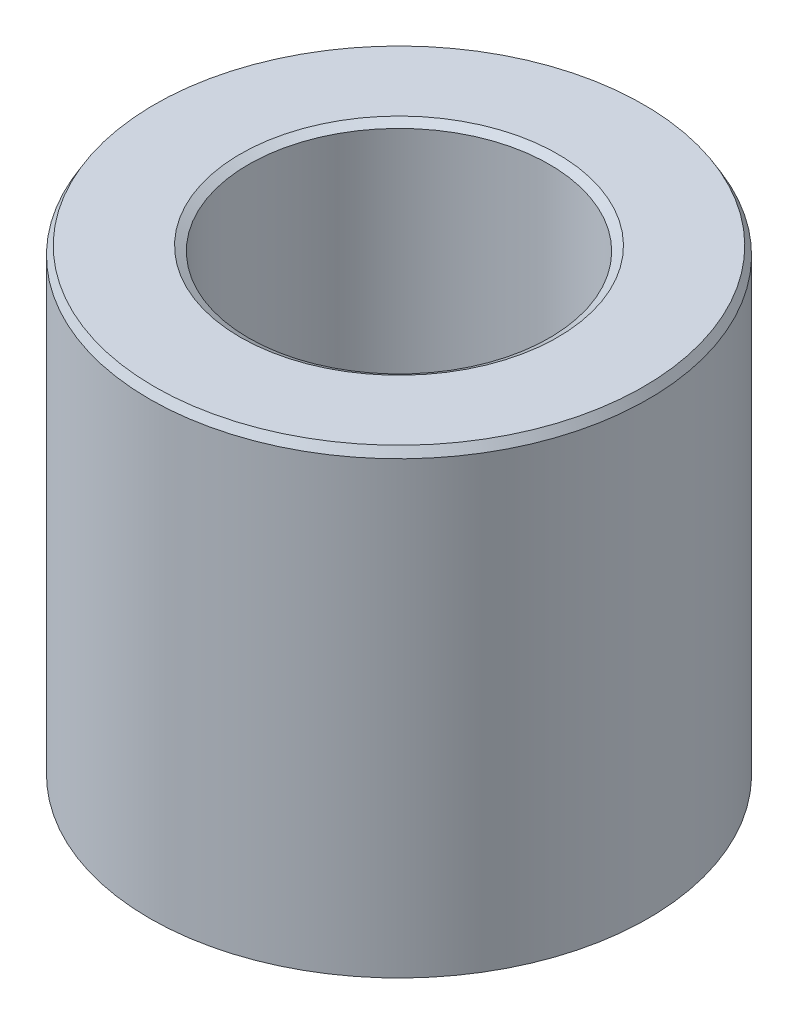
ISO-10303-21;
HEADER;
FILE_DESCRIPTION(('STEP AP214'),'2;1');
FILE_NAME('part.step','',(''),(''),'','','');
FILE_SCHEMA(('AUTOMOTIVE_DESIGN { 1 0 10303 214 1 1 1 1 }'));
ENDSEC;
DATA;
#1=APPLICATION_CONTEXT('core data for automotive mechanical design processes');
#2=APPLICATION_PROTOCOL_DEFINITION('international standard','automotive_design',2000,#1);
#3=PRODUCT_CONTEXT('',#1,'mechanical');
#4=PRODUCT('Part','Part','',(#3));
#5=PRODUCT_RELATED_PRODUCT_CATEGORY('part','',(#4));
#6=PRODUCT_DEFINITION_FORMATION('','',#4);
#7=PRODUCT_DEFINITION_CONTEXT('part definition',#1,'design');
#8=PRODUCT_DEFINITION('design','',#6,#7);
#9=PRODUCT_DEFINITION_SHAPE('','',#8);
#10=(LENGTH_UNIT() NAMED_UNIT(*) SI_UNIT(.MILLI.,.METRE.));
#11=(NAMED_UNIT(*) PLANE_ANGLE_UNIT() SI_UNIT($,.RADIAN.));
#12=(NAMED_UNIT(*) SI_UNIT($,.STERADIAN.) SOLID_ANGLE_UNIT());
#13=UNCERTAINTY_MEASURE_WITH_UNIT(LENGTH_MEASURE(1.E-05),#10,'distance_accuracy_value','');
#14=(GEOMETRIC_REPRESENTATION_CONTEXT(3) GLOBAL_UNCERTAINTY_ASSIGNED_CONTEXT((#13)) GLOBAL_UNIT_ASSIGNED_CONTEXT((#10,
#11,#12)) REPRESENTATION_CONTEXT('',''));
#15=CARTESIAN_POINT('',(0.,0.,0.));
#16=DIRECTION('',(0.,0.,1.));
#17=DIRECTION('',(1.,0.,0.));
#18=AXIS2_PLACEMENT_3D('',#15,#16,#17);
#19=CARTESIAN_POINT('',(0.,111.378244646813,0.));
#20=DIRECTION('',(0.,-1.,0.));
#21=DIRECTION('',(0.,0.,-1.));
#22=AXIS2_PLACEMENT_3D('',#19,#20,#21);
#23=CYLINDRICAL_SURFACE('',#22,60.);
#24=CARTESIAN_POINT('',(0.,1.15782947163648,0.));
#25=DIRECTION('',(0.,1.,0.));
#26=DIRECTION('',(0.,0.,1.));
#27=AXIS2_PLACEMENT_3D('',#24,#25,#26);
#28=CIRCLE('',#27,60.);
#29=CARTESIAN_POINT('',(0.,1.15782947163648,60.));
#30=VERTEX_POINT('',#29);
#31=EDGE_CURVE('E10',#30,#30,#28,.T.);
#32=ORIENTED_EDGE('',*,*,#31,.T.);
#33=EDGE_LOOP('',(#32));
#34=FACE_BOUND('',#33,.T.);
#35=CARTESIAN_POINT('',(0.,109.372825175438,0.));
#36=DIRECTION('',(0.,1.,0.));
#37=DIRECTION('',(0.,0.,1.));
#38=AXIS2_PLACEMENT_3D('',#35,#36,#37);
#39=CIRCLE('',#38,60.);
#40=CARTESIAN_POINT('',(0.,109.372825175438,60.));
#41=VERTEX_POINT('',#40);
#42=EDGE_CURVE('E50',#41,#41,#39,.F.);
#43=ORIENTED_EDGE('',*,*,#42,.T.);
#44=EDGE_LOOP('',(#43));
#45=FACE_BOUND('',#44,.T.);
#46=ADVANCED_FACE('F39',(#34,#45),#23,.T.);
#47=CARTESIAN_POINT('',(0.,111.378244646813,0.));
#48=DIRECTION('',(0.,1.,0.));
#49=DIRECTION('',(0.,0.,1.));
#50=AXIS2_PLACEMENT_3D('',#47,#48,#49);
#51=PLANE('',#50);
#52=CARTESIAN_POINT('',(0.,111.378244646813,0.));
#53=DIRECTION('',(0.,1.,0.));
#54=DIRECTION('',(0.,0.,1.));
#55=AXIS2_PLACEMENT_3D('',#52,#53,#54);
#56=CIRCLE('',#55,38.2008253274773);
#57=CARTESIAN_POINT('',(0.,111.378244646813,38.2008253274772));
#58=VERTEX_POINT('',#57);
#59=EDGE_CURVE('E58',#58,#58,#56,.F.);
#60=ORIENTED_EDGE('',*,*,#59,.T.);
#61=EDGE_LOOP('',(#60));
#62=FACE_BOUND('',#61,.T.);
#63=CARTESIAN_POINT('',(0.,111.378244646813,0.));
#64=DIRECTION('',(0.,1.,0.));
#65=DIRECTION('',(0.,0.,1.));
#66=AXIS2_PLACEMENT_3D('',#63,#64,#65);
#67=CIRCLE('',#66,58.8421705283635);
#68=CARTESIAN_POINT('',(0.,111.378244646813,58.8421705283635));
#69=VERTEX_POINT('',#68);
#70=EDGE_CURVE('E61',#69,#69,#67,.T.);
#71=ORIENTED_EDGE('',*,*,#70,.T.);
#72=EDGE_LOOP('',(#71));
#73=FACE_BOUND('',#72,.T.);
#74=ADVANCED_FACE('F88',(#62,#73),#51,.T.);
#75=CARTESIAN_POINT('',(0.,0.,0.));
#76=DIRECTION('',(0.,1.,0.));
#77=DIRECTION('',(0.,0.,1.));
#78=AXIS2_PLACEMENT_3D('',#75,#76,#77);
#79=PLANE('',#78);
#80=CARTESIAN_POINT('',(0.,0.,0.));
#81=DIRECTION('',(0.,1.,0.));
#82=DIRECTION('',(0.,0.,1.));
#83=AXIS2_PLACEMENT_3D('',#80,#81,#82);
#84=CIRCLE('',#83,37.3532353277387);
#85=CARTESIAN_POINT('',(0.,0.,37.3532353277387));
#86=VERTEX_POINT('',#85);
#87=EDGE_CURVE('E51',#86,#86,#84,.T.);
#88=ORIENTED_EDGE('',*,*,#87,.T.);
#89=EDGE_LOOP('',(#88));
#90=FACE_BOUND('',#89,.T.);
#91=CARTESIAN_POINT('',(0.,0.,0.));
#92=DIRECTION('',(0.,1.,0.));
#93=DIRECTION('',(0.,0.,1.));
#94=AXIS2_PLACEMENT_3D('',#91,#92,#93);
#95=CIRCLE('',#94,57.994580528625);
#96=CARTESIAN_POINT('',(0.,0.,57.994580528625));
#97=VERTEX_POINT('',#96);
#98=EDGE_CURVE('E54',#97,#97,#95,.F.);
#99=ORIENTED_EDGE('',*,*,#98,.T.);
#100=EDGE_LOOP('',(#99));
#101=FACE_BOUND('',#100,.T.);
#102=ADVANCED_FACE('F83',(#90,#101),#79,.F.);
#103=CARTESIAN_POINT('',(0.,111.378244646813,0.));
#104=DIRECTION('',(0.,-1.,0.));
#105=DIRECTION('',(0.,0.,-1.));
#106=AXIS2_PLACEMENT_3D('',#103,#104,#105);
#107=CYLINDRICAL_SURFACE('',#106,36.1954058561022);
#108=CARTESIAN_POINT('',(0.,110.220415175176,0.));
#109=DIRECTION('',(0.,1.,0.));
#110=DIRECTION('',(0.,0.,1.));
#111=AXIS2_PLACEMENT_3D('',#108,#109,#110);
#112=CIRCLE('',#111,36.1954058561022);
#113=CARTESIAN_POINT('',(0.,110.220415175176,36.1954058561022));
#114=VERTEX_POINT('',#113);
#115=EDGE_CURVE('E67',#114,#114,#112,.T.);
#116=ORIENTED_EDGE('',*,*,#115,.T.);
#117=EDGE_LOOP('',(#116));
#118=FACE_BOUND('',#117,.T.);
#119=CARTESIAN_POINT('',(0.,2.00541947137504,0.));
#120=DIRECTION('',(0.,1.,0.));
#121=DIRECTION('',(0.,0.,1.));
#122=AXIS2_PLACEMENT_3D('',#119,#120,#121);
#123=CIRCLE('',#122,36.1954058561022);
#124=CARTESIAN_POINT('',(0.,2.00541947137504,36.1954058561022));
#125=VERTEX_POINT('',#124);
#126=EDGE_CURVE('E69',#125,#125,#123,.F.);
#127=ORIENTED_EDGE('',*,*,#126,.T.);
#128=EDGE_LOOP('',(#127));
#129=FACE_BOUND('',#128,.T.);
#130=ADVANCED_FACE('F71',(#118,#129),#107,.F.);
#131=CARTESIAN_POINT('',(0.,110.220415175176,0.));
#132=DIRECTION('',(0.,1.,0.));
#133=DIRECTION('',(0.,0.,1.));
#134=AXIS2_PLACEMENT_3D('',#131,#132,#133);
#135=CONICAL_SURFACE('',#134,36.1954058561022,1.0471975511966);
#136=CARTESIAN_POINT('',(0.,111.378244646813,38.2008253274772));
#137=CARTESIAN_POINT('',(0.,111.36618392315,38.1799355413171));
#138=CARTESIAN_POINT('',(0.,111.354123199487,38.1590457551569));
#139=CARTESIAN_POINT('',(0.,111.330001752161,38.1172661828366));
#140=CARTESIAN_POINT('',(0.,111.317941028498,38.0963763966765));
#141=CARTESIAN_POINT('',(0.,111.293819581173,38.0545968243562));
#142=CARTESIAN_POINT('',(0.,111.28175885751,38.033707038196));
#143=CARTESIAN_POINT('',(0.,111.257637410184,37.9919274658757));
#144=CARTESIAN_POINT('',(0.,111.245576686521,37.9710376797155));
#145=CARTESIAN_POINT('',(0.,111.221455239195,37.9292581073952));
#146=CARTESIAN_POINT('',(0.,111.209394515533,37.9083683212351));
#147=CARTESIAN_POINT('',(0.,111.185273068207,37.8665887489148));
#148=CARTESIAN_POINT('',(0.,111.173212344544,37.8456989627546));
#149=CARTESIAN_POINT('',(0.,111.149090897218,37.8039193904343));
#150=CARTESIAN_POINT('',(0.,111.137030173555,37.7830296042741));
#151=CARTESIAN_POINT('',(0.,111.112908726229,37.7412500319538));
#152=CARTESIAN_POINT('',(0.,111.100848002567,37.7203602457936));
#153=CARTESIAN_POINT('',(0.,111.076726555241,37.6785806734733));
#154=CARTESIAN_POINT('',(0.,111.064665831578,37.6576908873132));
#155=CARTESIAN_POINT('',(0.,111.040544384252,37.6159113149929));
#156=CARTESIAN_POINT('',(0.,111.028483660589,37.5950215288327));
#157=CARTESIAN_POINT('',(0.,111.004362213264,37.5532419565124));
#158=CARTESIAN_POINT('',(0.,110.992301489601,37.5323521703522));
#159=CARTESIAN_POINT('',(0.,110.968180042275,37.4905725980319));
#160=CARTESIAN_POINT('',(0.,110.956119318612,37.4696828118718));
#161=CARTESIAN_POINT('',(0.,110.931997871286,37.4279032395515));
#162=CARTESIAN_POINT('',(0.,110.919937147623,37.4070134533913));
#163=CARTESIAN_POINT('',(0.,110.895815700298,37.365233881071));
#164=CARTESIAN_POINT('',(0.,110.883754976635,37.3443440949108));
#165=CARTESIAN_POINT('',(0.,110.859633529309,37.3025645225905));
#166=CARTESIAN_POINT('',(0.,110.847572805646,37.2816747364304));
#167=CARTESIAN_POINT('',(0.,110.82345135832,37.2398951641101));
#168=CARTESIAN_POINT('',(0.,110.811390634657,37.2190053779499));
#169=CARTESIAN_POINT('',(0.,110.787269187332,37.1772258056296));
#170=CARTESIAN_POINT('',(0.,110.775208463669,37.1563360194694));
#171=CARTESIAN_POINT('',(0.,110.751087016343,37.1145564471491));
#172=CARTESIAN_POINT('',(0.,110.73902629268,37.093666660989));
#173=CARTESIAN_POINT('',(0.,110.714904845354,37.0518870886686));
#174=CARTESIAN_POINT('',(0.,110.702844121692,37.0309973025085));
#175=CARTESIAN_POINT('',(0.,110.678722674366,36.9892177301882));
#176=CARTESIAN_POINT('',(0.,110.666661950703,36.968327944028));
#177=CARTESIAN_POINT('',(0.,110.642540503377,36.9265483717077));
#178=CARTESIAN_POINT('',(0.,110.630479779714,36.9056585855475));
#179=CARTESIAN_POINT('',(0.,110.606358332389,36.8638790132272));
#180=CARTESIAN_POINT('',(0.,110.594297608726,36.8429892270671));
#181=CARTESIAN_POINT('',(0.,110.5701761614,36.8012096547468));
#182=CARTESIAN_POINT('',(0.,110.558115437737,36.7803198685866));
#183=CARTESIAN_POINT('',(0.,110.533993990411,36.7385402962663));
#184=CARTESIAN_POINT('',(0.,110.521933266748,36.7176505101061));
#185=CARTESIAN_POINT('',(0.,110.497811819423,36.6758709377858));
#186=CARTESIAN_POINT('',(0.,110.48575109576,36.6549811516257));
#187=CARTESIAN_POINT('',(0.,110.461629648434,36.6132015793054));
#188=CARTESIAN_POINT('',(0.,110.449568924771,36.5923117931452));
#189=CARTESIAN_POINT('',(0.,110.425447477445,36.5505322208249));
#190=CARTESIAN_POINT('',(0.,110.413386753782,36.5296424346647));
#191=CARTESIAN_POINT('',(0.,110.389265306457,36.4878628623444));
#192=CARTESIAN_POINT('',(0.,110.377204582794,36.4669730761843));
#193=CARTESIAN_POINT('',(0.,110.353083135468,36.425193503864));
#194=CARTESIAN_POINT('',(0.,110.341022411805,36.4043037177038));
#195=CARTESIAN_POINT('',(0.,110.316900964479,36.3625241453835));
#196=CARTESIAN_POINT('',(0.,110.304840240817,36.3416343592233));
#197=CARTESIAN_POINT('',(0.,110.280718793491,36.299854786903));
#198=CARTESIAN_POINT('',(0.,110.268658069828,36.2789650007429));
#199=CARTESIAN_POINT('',(0.,110.244536622502,36.2371854284225));
#200=CARTESIAN_POINT('',(0.,110.232475898839,36.2162956422624));
#201=CARTESIAN_POINT('',(0.,110.220415175176,36.1954058561022));
#202=B_SPLINE_CURVE_WITH_KNOTS('',3,(#136,#137,#138,#139,#140,#141,#142,#143,#144,#145,#146,
#147,#148,#149,#150,#151,#152,#153,#154,#155,#156,#157,#158,#159,#160,#161,#162,#163,#164,#165,
#166,#167,#168,#169,#170,#171,#172,#173,#174,#175,#176,#177,#178,#179,#180,#181,#182,#183,#184,
#185,#186,#187,#188,#189,#190,#191,#192,#193,#194,#195,#196,#197,#198,#199,#200,#201),
.UNSPECIFIED.,.F.,.F.,(4,2,2,2,2,2,2,2,2,2,2,2,2,2,2,2,2,2,2,2,2,2,2,2,2,2,2,2,2,2,2,2,4),(0.,
0.0723643419772776,0.144728683954555,0.217093025931833,0.289457367909117,0.361821709886395,
0.434186051863672,0.506550393840957,0.578914735818234,0.651279077795512,0.723643419772796,
0.796007761750074,0.868372103727352,0.940736445704642,1.01310078768192,1.0854651296592,
1.15782947163648,1.23019381361376,1.30255815559104,1.37492249756831,1.4472868395456,
1.51965118152288,1.59201552350015,1.66437986547744,1.73674420745472,1.80910854943199,
1.88147289140928,1.95383723338656,2.02620157536383,2.09856591734112,2.1709302593184,
2.24329460129568,2.31565894327296),.UNSPECIFIED.);
#203=EDGE_CURVE('BSEAM77',#58,#114,#202,.T.);
#204=ORIENTED_EDGE('',*,*,#59,.F.);
#205=ORIENTED_EDGE('',*,*,#115,.F.);
#206=ORIENTED_EDGE('',*,*,#203,.T.);
#207=ORIENTED_EDGE('',*,*,#203,.F.);
#208=EDGE_LOOP('',(#204,#206,#205,#207));
#209=FACE_BOUND('',#208,.T.);
#210=ADVANCED_FACE('F77',(#209),#135,.F.);
#211=CARTESIAN_POINT('',(0.,0.,0.));
#212=DIRECTION('',(0.,-1.,0.));
#213=DIRECTION('',(0.,0.,-1.));
#214=AXIS2_PLACEMENT_3D('',#211,#212,#213);
#215=CONICAL_SURFACE('',#214,37.3532353277387,0.523598775598297);
#216=ORIENTED_EDGE('',*,*,#126,.F.);
#217=EDGE_LOOP('',(#216));
#218=FACE_BOUND('',#217,.T.);
#219=ORIENTED_EDGE('',*,*,#87,.F.);
#220=EDGE_LOOP('',(#219));
#221=FACE_BOUND('',#220,.T.);
#222=ADVANCED_FACE('F73',(#218,#221),#215,.F.);
#223=CARTESIAN_POINT('',(0.,1.15782947163648,0.));
#224=DIRECTION('',(0.,1.,0.));
#225=DIRECTION('',(0.,0.,1.));
#226=AXIS2_PLACEMENT_3D('',#223,#224,#225);
#227=CONICAL_SURFACE('',#226,60.,1.0471975511966);
#228=CARTESIAN_POINT('',(0.,0.,57.994580528625));
#229=CARTESIAN_POINT('',(0.,0.0120607236628798,58.0154703147851));
#230=CARTESIAN_POINT('',(0.,0.0241214473257598,58.0363601009453));
#231=CARTESIAN_POINT('',(0.,0.0482428946515197,58.0781396732656));
#232=CARTESIAN_POINT('',(0.,0.0603036183143997,58.0990294594258));
#233=CARTESIAN_POINT('',(0.,0.0844250656401597,58.1408090317461));
#234=CARTESIAN_POINT('',(0.,0.0964857893030397,58.1616988179062));
#235=CARTESIAN_POINT('',(0.,0.1206072366288,58.2034783902265));
#236=CARTESIAN_POINT('',(0.,0.13266796029168,58.2243681763867));
#237=CARTESIAN_POINT('',(0.,0.15678940761744,58.266147748707));
#238=CARTESIAN_POINT('',(0.,0.16885013128032,58.2870375348672));
#239=CARTESIAN_POINT('',(0.,0.19297157860608,58.3288171071875));
#240=CARTESIAN_POINT('',(0.,0.20503230226896,58.3497068933476));
#241=CARTESIAN_POINT('',(0.,0.229153749594719,58.3914864656679));
#242=CARTESIAN_POINT('',(0.,0.241214473257599,58.4123762518281));
#243=CARTESIAN_POINT('',(0.,0.265335920583359,58.4541558241484));
#244=CARTESIAN_POINT('',(0.,0.277396644246239,58.4750456103086));
#245=CARTESIAN_POINT('',(0.,0.301518091571999,58.5168251826289));
#246=CARTESIAN_POINT('',(0.,0.313578815234879,58.537714968789));
#247=CARTESIAN_POINT('',(0.,0.33770026256064,58.5794945411094));
#248=CARTESIAN_POINT('',(0.,0.34976098622352,58.6003843272695));
#249=CARTESIAN_POINT('',(0.,0.37388243354928,58.6421638995898));
#250=CARTESIAN_POINT('',(0.,0.385943157212159,58.66305368575));
#251=CARTESIAN_POINT('',(0.,0.410064604537919,58.7048332580703));
#252=CARTESIAN_POINT('',(0.,0.422125328200799,58.7257230442305));
#253=CARTESIAN_POINT('',(0.,0.44624677552656,58.7675026165508));
#254=CARTESIAN_POINT('',(0.,0.458307499189439,58.7883924027109));
#255=CARTESIAN_POINT('',(0.,0.482428946515199,58.8301719750312));
#256=CARTESIAN_POINT('',(0.,0.494489670178079,58.8510617611914));
#257=CARTESIAN_POINT('',(0.,0.518611117503839,58.8928413335117));
#258=CARTESIAN_POINT('',(0.,0.530671841166719,58.9137311196719));
#259=CARTESIAN_POINT('',(0.,0.554793288492479,58.9555106919922));
#260=CARTESIAN_POINT('',(0.,0.566854012155359,58.9764004781523));
#261=CARTESIAN_POINT('',(0.,0.590975459481119,59.0181800504726));
#262=CARTESIAN_POINT('',(0.,0.603036183143999,59.0390698366328));
#263=CARTESIAN_POINT('',(0.,0.627157630469759,59.0808494089531));
#264=CARTESIAN_POINT('',(0.,0.639218354132639,59.1017391951133));
#265=CARTESIAN_POINT('',(0.,0.663339801458399,59.1435187674336));
#266=CARTESIAN_POINT('',(0.,0.675400525121279,59.1644085535937));
#267=CARTESIAN_POINT('',(0.,0.699521972447039,59.2061881259141));
#268=CARTESIAN_POINT('',(0.,0.711582696109919,59.2270779120742));
#269=CARTESIAN_POINT('',(0.,0.735704143435679,59.2688574843945));
#270=CARTESIAN_POINT('',(0.,0.747764867098559,59.2897472705547));
#271=CARTESIAN_POINT('',(0.,0.771886314424319,59.331526842875));
#272=CARTESIAN_POINT('',(0.,0.783947038087199,59.3524166290351));
#273=CARTESIAN_POINT('',(0.,0.808068485412959,59.3941962013555));
#274=CARTESIAN_POINT('',(0.,0.820129209075839,59.4150859875156));
#275=CARTESIAN_POINT('',(0.,0.844250656401599,59.4568655598359));
#276=CARTESIAN_POINT('',(0.,0.85631138006448,59.4777553459961));
#277=CARTESIAN_POINT('',(0.,0.880432827390239,59.5195349183164));
#278=CARTESIAN_POINT('',(0.,0.892493551053119,59.5404247044766));
#279=CARTESIAN_POINT('',(0.,0.916614998378878,59.5822042767969));
#280=CARTESIAN_POINT('',(0.,0.928675722041759,59.603094062957));
#281=CARTESIAN_POINT('',(0.,0.952797169367519,59.6448736352773));
#282=CARTESIAN_POINT('',(0.,0.964857893030399,59.6657634214375));
#283=CARTESIAN_POINT('',(0.,0.988979340356159,59.7075429937578));
#284=CARTESIAN_POINT('',(0.,1.00104006401904,59.728432779918));
#285=CARTESIAN_POINT('',(0.,1.0251615113448,59.7702123522383));
#286=CARTESIAN_POINT('',(0.,1.03722223500768,59.7911021383984));
#287=CARTESIAN_POINT('',(0.,1.06134368233344,59.8328817107187));
#288=CARTESIAN_POINT('',(0.,1.07340440599632,59.8537714968789));
#289=CARTESIAN_POINT('',(0.,1.09752585332208,59.8955510691992));
#290=CARTESIAN_POINT('',(0.,1.10958657698496,59.9164408553594));
#291=CARTESIAN_POINT('',(0.,1.13370802431072,59.9582204276797));
#292=CARTESIAN_POINT('',(0.,1.1457687479736,59.9791102138398));
#293=CARTESIAN_POINT('',(0.,1.15782947163648,60.));
#294=B_SPLINE_CURVE_WITH_KNOTS('',3,(#228,#229,#230,#231,#232,#233,#234,#235,#236,#237,#238,
#239,#240,#241,#242,#243,#244,#245,#246,#247,#248,#249,#250,#251,#252,#253,#254,#255,#256,#257,
#258,#259,#260,#261,#262,#263,#264,#265,#266,#267,#268,#269,#270,#271,#272,#273,#274,#275,#276,
#277,#278,#279,#280,#281,#282,#283,#284,#285,#286,#287,#288,#289,#290,#291,#292,#293),
.UNSPECIFIED.,.F.,.F.,(4,2,2,2,2,2,2,2,2,2,2,2,2,2,2,2,2,2,2,2,2,2,2,2,2,2,2,2,2,2,2,2,4),(0.,
0.0723643419772797,0.144728683954559,0.217093025931839,0.289457367909119,0.361821709886399,
0.434186051863678,0.506550393840958,0.578914735818238,0.651279077795518,0.723643419772797,
0.796007761750083,0.868372103727363,0.940736445704643,1.01310078768192,1.0854651296592,
1.15782947163648,1.23019381361376,1.30255815559104,1.37492249756832,1.4472868395456,
1.51965118152288,1.59201552350016,1.66437986547744,1.73674420745472,1.80910854943201,
1.88147289140929,1.95383723338656,2.02620157536384,2.09856591734112,2.1709302593184,
2.24329460129568,2.31565894327296),.UNSPECIFIED.);
#295=EDGE_CURVE('BSEAM76',#97,#30,#294,.T.);
#296=ORIENTED_EDGE('',*,*,#98,.F.);
#297=ORIENTED_EDGE('',*,*,#31,.F.);
#298=ORIENTED_EDGE('',*,*,#295,.T.);
#299=ORIENTED_EDGE('',*,*,#295,.F.);
#300=EDGE_LOOP('',(#296,#298,#297,#299));
#301=FACE_BOUND('',#300,.T.);
#302=ADVANCED_FACE('F76',(#301),#227,.T.);
#303=CARTESIAN_POINT('',(0.,111.378244646813,0.));
#304=DIRECTION('',(0.,-1.,0.));
#305=DIRECTION('',(0.,0.,-1.));
#306=AXIS2_PLACEMENT_3D('',#303,#304,#305);
#307=CONICAL_SURFACE('',#306,58.8421705283635,0.523598775598298);
#308=ORIENTED_EDGE('',*,*,#42,.F.);
#309=EDGE_LOOP('',(#308));
#310=FACE_BOUND('',#309,.T.);
#311=ORIENTED_EDGE('',*,*,#70,.F.);
#312=EDGE_LOOP('',(#311));
#313=FACE_BOUND('',#312,.T.);
#314=ADVANCED_FACE('F45',(#310,#313),#307,.T.);
#315=CLOSED_SHELL('',(#46,#74,#102,#130,#210,#222,#302,#314));
#316=MANIFOLD_SOLID_BREP('B2',#315);
#317=ADVANCED_BREP_SHAPE_REPRESENTATION('',(#18,#316),#14);
#318=SHAPE_DEFINITION_REPRESENTATION(#9,#317);
ENDSEC;
END-ISO-10303-21;
